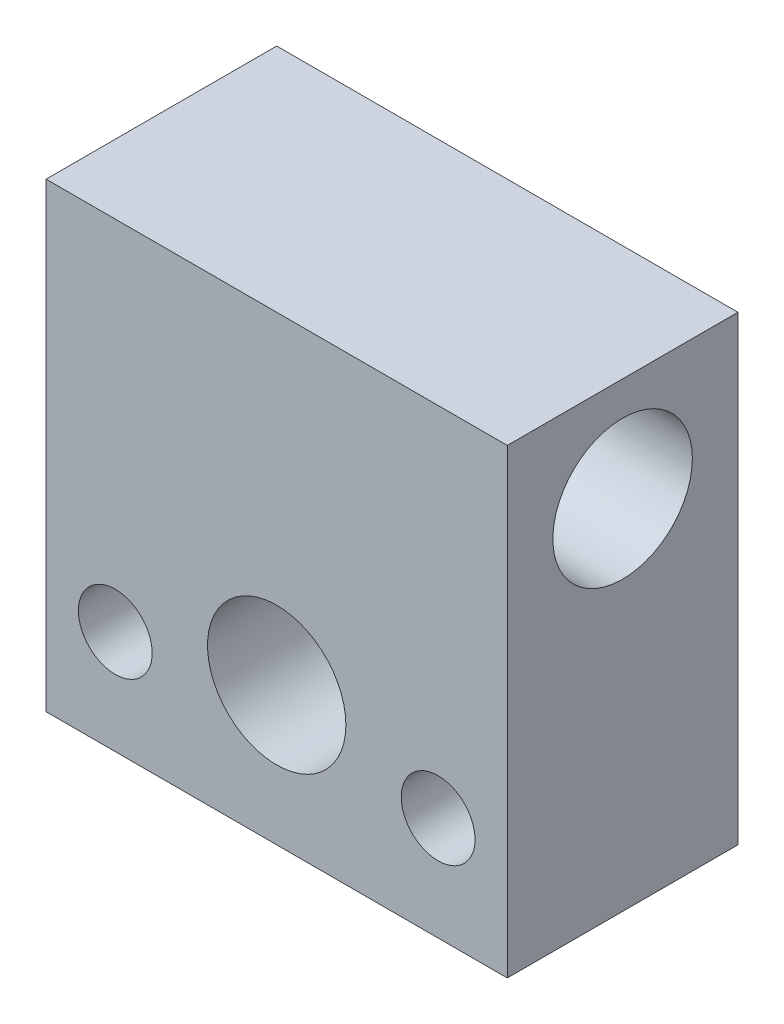
ISO-10303-21;
HEADER;
FILE_DESCRIPTION(('STEP AP214'),'2;1');
FILE_NAME('part.step','',(''),(''),'','','');
FILE_SCHEMA(('AUTOMOTIVE_DESIGN { 1 0 10303 214 1 1 1 1 }'));
ENDSEC;
DATA;
#1=APPLICATION_CONTEXT('core data for automotive mechanical design processes');
#2=APPLICATION_PROTOCOL_DEFINITION('international standard','automotive_design',2000,#1);
#3=PRODUCT_CONTEXT('',#1,'mechanical');
#4=PRODUCT('Part','Part','',(#3));
#5=PRODUCT_RELATED_PRODUCT_CATEGORY('part','',(#4));
#6=PRODUCT_DEFINITION_FORMATION('','',#4);
#7=PRODUCT_DEFINITION_CONTEXT('part definition',#1,'design');
#8=PRODUCT_DEFINITION('design','',#6,#7);
#9=PRODUCT_DEFINITION_SHAPE('','',#8);
#10=(LENGTH_UNIT() NAMED_UNIT(*) SI_UNIT(.MILLI.,.METRE.));
#11=(NAMED_UNIT(*) PLANE_ANGLE_UNIT() SI_UNIT($,.RADIAN.));
#12=(NAMED_UNIT(*) SI_UNIT($,.STERADIAN.) SOLID_ANGLE_UNIT());
#13=UNCERTAINTY_MEASURE_WITH_UNIT(LENGTH_MEASURE(1.E-05),#10,'distance_accuracy_value','');
#14=(GEOMETRIC_REPRESENTATION_CONTEXT(3) GLOBAL_UNCERTAINTY_ASSIGNED_CONTEXT((#13)) GLOBAL_UNIT_ASSIGNED_CONTEXT((#10,
#11,#12)) REPRESENTATION_CONTEXT('',''));
#15=CARTESIAN_POINT('',(0.,0.,0.));
#16=DIRECTION('',(0.,0.,1.));
#17=DIRECTION('',(1.,0.,0.));
#18=AXIS2_PLACEMENT_3D('',#15,#16,#17);
#19=CARTESIAN_POINT('',(-5.,0.,10.));
#20=DIRECTION('',(-1.,0.,0.));
#21=DIRECTION('',(0.,0.,1.));
#22=AXIS2_PLACEMENT_3D('',#19,#20,#21);
#23=PLANE('',#22);
#24=CARTESIAN_POINT('',(-5.,-1.5,2.));
#25=DIRECTION('',(-1.,0.,0.));
#26=DIRECTION('',(0.,0.,1.));
#27=AXIS2_PLACEMENT_3D('',#24,#25,#26);
#28=CIRCLE('',#27,1.);
#29=CARTESIAN_POINT('',(-5.,-1.5,3.));
#30=VERTEX_POINT('',#29);
#31=EDGE_CURVE('E18',#30,#30,#28,.T.);
#32=ORIENTED_EDGE('',*,*,#31,.T.);
#33=EDGE_LOOP('',(#32));
#34=FACE_BOUND('',#33,.T.);
#35=ADVANCED_FACE('F15',(#34),#23,.T.);
#36=CARTESIAN_POINT('',(-6.,0.,0.));
#37=DIRECTION('',(-1.,0.,0.));
#38=DIRECTION('',(0.,0.,1.));
#39=AXIS2_PLACEMENT_3D('',#36,#37,#38);
#40=PLANE('',#39);
#41=CARTESIAN_POINT('',(-6.,-1.5,5.5));
#42=DIRECTION('',(-1.,0.,0.));
#43=DIRECTION('',(0.,0.,1.));
#44=AXIS2_PLACEMENT_3D('',#41,#42,#43);
#45=CIRCLE('',#44,1.5);
#46=CARTESIAN_POINT('',(-6.,-1.5,7.));
#47=VERTEX_POINT('',#46);
#48=EDGE_CURVE('E128',#47,#47,#45,.T.);
#49=ORIENTED_EDGE('',*,*,#48,.T.);
#50=EDGE_LOOP('',(#49));
#51=FACE_BOUND('',#50,.T.);
#52=ADVANCED_FACE('F157',(#51),#40,.T.);
#53=CARTESIAN_POINT('',(0.,5.5,0.));
#54=DIRECTION('',(0.,0.,-1.));
#55=DIRECTION('',(-1.,0.,0.));
#56=AXIS2_PLACEMENT_3D('',#53,#54,#55);
#57=CYLINDRICAL_SURFACE('',#56,1.5);
#58=CARTESIAN_POINT('',(1.5,5.5,1.975));
#59=CARTESIAN_POINT('',(1.49999594047018,5.57900144630801,1.97500356043906));
#60=CARTESIAN_POINT('',(1.49372693576098,5.65804837745387,1.97812566666901));
#61=CARTESIAN_POINT('',(1.46893959830404,5.81376412220572,1.99029966306556));
#62=CARTESIAN_POINT('',(1.45040864995801,5.89043040135985,1.99935766023134));
#63=CARTESIAN_POINT('',(1.40199846961452,6.03896385695773,2.02245479182461));
#64=CARTESIAN_POINT('',(1.37215905632387,6.11084684381869,2.03647643725468));
#65=CARTESIAN_POINT('',(1.30219691790721,6.24849863267949,2.06821357281648));
#66=CARTESIAN_POINT('',(1.26207301806937,6.31426673505646,2.08592948487061));
#67=CARTESIAN_POINT('',(1.16995731065494,6.44222108280155,2.12466073278959));
#68=CARTESIAN_POINT('',(1.11739997976672,6.50395906458766,2.14580990556196));
#69=CARTESIAN_POINT('',(1.0031271487249,6.61815419955558,2.18858021506086));
#70=CARTESIAN_POINT('',(0.941405217206993,6.67060477806009,2.21020167405788));
#71=CARTESIAN_POINT('',(0.804926658722086,6.76873167990099,2.25335964948605));
#72=CARTESIAN_POINT('',(0.729536017881986,6.81359067773629,2.27476493273293));
#73=CARTESIAN_POINT('',(0.571103482437755,6.88980291346821,2.31282681627039));
#74=CARTESIAN_POINT('',(0.4880670033303,6.92116562271595,2.32948674394543));
#75=CARTESIAN_POINT('',(0.321740750954993,6.96747419696827,2.35466323851127));
#76=CARTESIAN_POINT('',(0.238759352163179,6.98328499768358,2.36360494965244));
#77=CARTESIAN_POINT('',(0.0708794694097341,7.00069285570871,2.37347037411611));
#78=CARTESIAN_POINT('',(-0.0140171024281057,7.00230351116717,2.3744017581574));
#79=CARTESIAN_POINT('',(-0.172629443740668,6.99190046308059,2.36848430022382));
#80=CARTESIAN_POINT('',(-0.246490058966555,6.98146052673182,2.36253400278224));
#81=CARTESIAN_POINT('',(-0.391230964006536,6.94997459930692,2.34509525123016));
#82=CARTESIAN_POINT('',(-0.46211032721989,6.92892533676304,2.33360508890698));
#83=CARTESIAN_POINT('',(-0.600898386504531,6.87642947527521,2.30612583887848));
#84=CARTESIAN_POINT('',(-0.668699211124015,6.84475178294496,2.29003805345798));
#85=CARTESIAN_POINT('',(-0.798344551502015,6.77207503652154,2.25517346346266));
#86=CARTESIAN_POINT('',(-0.860186510561525,6.73107200644798,2.23639551316821));
#87=CARTESIAN_POINT('',(-0.984256578247225,6.63496133604325,2.19544298686002));
#88=CARTESIAN_POINT('',(-1.04557656112961,6.57873384380673,2.17313639274875));
#89=CARTESIAN_POINT('',(-1.15830345819555,6.45668082223522,2.12953202590372));
#90=CARTESIAN_POINT('',(-1.20970387570264,6.3908490519359,2.10823492116113));
#91=CARTESIAN_POINT('',(-1.30330651599731,6.24768473858028,2.067873118354));
#92=CARTESIAN_POINT('',(-1.34498421172647,6.16996535849951,2.04895396414971));
#93=CARTESIAN_POINT('',(-1.41428907876496,6.00749420403244,2.01673148934985));
#94=CARTESIAN_POINT('',(-1.44194305133928,5.92275620668402,2.00341746491714));
#95=CARTESIAN_POINT('',(-1.47450721867071,5.78107868035783,1.98757839526593));
#96=CARTESIAN_POINT('',(-1.48404343221979,5.7254041139936,1.98288549806455));
#97=CARTESIAN_POINT('',(-1.49679098596232,5.61316075670564,1.97659516756892));
#98=CARTESIAN_POINT('',(-1.50000290801143,5.55659204852868,1.97499744950821));
#99=CARTESIAN_POINT('',(-1.49999594047018,5.42099855369198,1.97500356043906));
#100=CARTESIAN_POINT('',(-1.49372693576097,5.34195162254613,1.97812566666901));
#101=CARTESIAN_POINT('',(-1.46893959830404,5.18623587779428,1.99029966306556));
#102=CARTESIAN_POINT('',(-1.45040864995801,5.10956959864015,1.99935766023134));
#103=CARTESIAN_POINT('',(-1.40199846961452,4.96103614304227,2.02245479182461));
#104=CARTESIAN_POINT('',(-1.37215905632387,4.88915315618131,2.03647643725468));
#105=CARTESIAN_POINT('',(-1.30219691790721,4.75150136732051,2.06821357281648));
#106=CARTESIAN_POINT('',(-1.26207301806937,4.68573326494354,2.08592948487061));
#107=CARTESIAN_POINT('',(-1.16995731065493,4.55777891719845,2.12466073278959));
#108=CARTESIAN_POINT('',(-1.11739997976672,4.49604093541234,2.14580990556196));
#109=CARTESIAN_POINT('',(-1.0031271487249,4.38184580044442,2.18858021506086));
#110=CARTESIAN_POINT('',(-0.941405217206992,4.32939522193991,2.21020167405788));
#111=CARTESIAN_POINT('',(-0.804926658722085,4.23126832009901,2.25335964948605));
#112=CARTESIAN_POINT('',(-0.729536017881984,4.18640932226371,2.27476493273293));
#113=CARTESIAN_POINT('',(-0.571103482437753,4.11019708653179,2.31282681627039));
#114=CARTESIAN_POINT('',(-0.488067003330298,4.07883437728405,2.32948674394543));
#115=CARTESIAN_POINT('',(-0.321740750954991,4.03252580303173,2.35466323851127));
#116=CARTESIAN_POINT('',(-0.238759352163177,4.01671500231642,2.36360494965244));
#117=CARTESIAN_POINT('',(-0.070879469409732,3.99930714429129,2.37347037411611));
#118=CARTESIAN_POINT('',(0.0140171024281078,3.99769648883283,2.3744017581574));
#119=CARTESIAN_POINT('',(0.17262944374067,4.00809953691941,2.36848430022382));
#120=CARTESIAN_POINT('',(0.246490058966557,4.01853947326818,2.36253400278224));
#121=CARTESIAN_POINT('',(0.391230964006538,4.05002540069308,2.34509525123016));
#122=CARTESIAN_POINT('',(0.462110327219892,4.07107466323696,2.33360508890698));
#123=CARTESIAN_POINT('',(0.600898386504532,4.12357052472479,2.30612583887848));
#124=CARTESIAN_POINT('',(0.668699211124016,4.15524821705504,2.29003805345798));
#125=CARTESIAN_POINT('',(0.798344551502016,4.22792496347846,2.25517346346266));
#126=CARTESIAN_POINT('',(0.860186510561526,4.26892799355202,2.23639551316821));
#127=CARTESIAN_POINT('',(0.984256578247227,4.36503866395675,2.19544298686002));
#128=CARTESIAN_POINT('',(1.04557656112961,4.42126615619327,2.17313639274875));
#129=CARTESIAN_POINT('',(1.15830345819555,4.54331917776478,2.12953202590372));
#130=CARTESIAN_POINT('',(1.20970387570264,4.6091509480641,2.10823492116113));
#131=CARTESIAN_POINT('',(1.30330651599732,4.75231526141973,2.067873118354));
#132=CARTESIAN_POINT('',(1.34498421172647,4.83003464150049,2.04895396414971));
#133=CARTESIAN_POINT('',(1.41428907876496,4.99250579596756,2.01673148934985));
#134=CARTESIAN_POINT('',(1.44194305133928,5.07724379331598,2.00341746491714));
#135=CARTESIAN_POINT('',(1.47450721867071,5.21892131964217,1.98757839526593));
#136=CARTESIAN_POINT('',(1.48404343221979,5.2745958860064,1.98288549806455));
#137=CARTESIAN_POINT('',(1.49679098596232,5.38683924329436,1.97659516756892));
#138=CARTESIAN_POINT('',(1.50000290801143,5.44340795147132,1.97499744950821));
#139=CARTESIAN_POINT('',(1.5,5.5,1.975));
#140=B_SPLINE_CURVE_WITH_KNOTS('',3,(#58,#59,#60,#61,#62,#63,#64,#65,#66,#67,#68,#69,#70,#71,
#72,#73,#74,#75,#76,#77,#78,#79,#80,#81,#82,#83,#84,#85,#86,#87,#88,#89,#90,#91,#92,#93,#94,#95,
#96,#97,#98,#99,#100,#101,#102,#103,#104,#105,#106,#107,#108,#109,#110,#111,#112,#113,#114,#115,
#116,#117,#118,#119,#120,#121,#122,#123,#124,#125,#126,#127,#128,#129,#130,#131,#132,#133,#134,
#135,#136,#137,#138,#139),.UNSPECIFIED.,.T.,.F.,(4,2,2,2,2,2,2,2,2,2,2,2,2,2,2,2,2,2,2,2,2,2,2,
2,2,2,2,2,2,2,2,2,2,2,2,2,2,2,2,2,4),(0.,0.236782321681719,0.473808634445435,0.710007983763761,
0.946234324211956,1.1965638581735,1.44706990138711,1.71660637764891,1.98595339038829,
2.23929197683291,2.49238793826836,2.71583794222608,2.93935689091262,3.16809007155546,
3.39692095903474,3.65420522783989,3.91165743363485,4.18081624560758,4.44945870091991,
4.61909141374399,4.78870851907015,5.02549084075187,5.26251715351558,5.49871650283391,
5.7349428432821,5.98527237724365,6.23577842045725,6.50531489671906,6.77466190945843,
7.02800049590306,7.28109645733851,7.50454646129622,7.72806540998277,7.9567985906256,
8.18562947810489,8.44291374691004,8.700365952705,8.96952476467773,9.23816721999005,
9.40779993281413,9.57741703814029),.UNSPECIFIED.);
#141=CARTESIAN_POINT('',(1.5,5.5,1.975));
#142=VERTEX_POINT('',#141);
#143=EDGE_CURVE('E122',#142,#142,#140,.T.);
#144=ORIENTED_EDGE('',*,*,#143,.T.);
#145=EDGE_LOOP('',(#144));
#146=FACE_BOUND('',#145,.T.);
#147=CARTESIAN_POINT('',(0.,5.5,0.));
#148=DIRECTION('',(0.,0.,-1.));
#149=DIRECTION('',(-1.,0.,0.));
#150=AXIS2_PLACEMENT_3D('',#147,#148,#149);
#151=CIRCLE('',#150,1.5);
#152=CARTESIAN_POINT('',(-1.5,5.5,0.));
#153=VERTEX_POINT('',#152);
#154=EDGE_CURVE('E119',#153,#153,#151,.T.);
#155=ORIENTED_EDGE('',*,*,#154,.T.);
#156=EDGE_LOOP('',(#155));
#157=FACE_BOUND('',#156,.T.);
#158=ADVANCED_FACE('F129',(#146,#157),#57,.F.);
#159=CARTESIAN_POINT('',(-7.,-5.5,5.6843418860808E-11));
#160=DIRECTION('',(0.,0.,-1.));
#161=DIRECTION('',(-1.,0.,0.));
#162=AXIS2_PLACEMENT_3D('',#159,#160,#161);
#163=CONICAL_SURFACE('',#162,2.80000000009795,0.785398163397448);
#164=CARTESIAN_POINT('',(-7.,-5.5,1.2));
#165=DIRECTION('',(0.,0.,1.));
#166=DIRECTION('',(1.,0.,0.));
#167=AXIS2_PLACEMENT_3D('',#164,#165,#166);
#168=CIRCLE('',#167,1.6);
#169=CARTESIAN_POINT('',(-5.4,-5.5,1.2));
#170=VERTEX_POINT('',#169);
#171=EDGE_CURVE('E91',#170,#170,#168,.T.);
#172=ORIENTED_EDGE('',*,*,#171,.T.);
#173=EDGE_LOOP('',(#172));
#174=FACE_BOUND('',#173,.T.);
#175=CARTESIAN_POINT('',(-7.,-5.5,5.6843418860808E-11));
#176=DIRECTION('',(0.,0.,-1.));
#177=DIRECTION('',(-1.,0.,0.));
#178=AXIS2_PLACEMENT_3D('',#175,#176,#177);
#179=CIRCLE('',#178,2.80000000009795);
#180=CARTESIAN_POINT('',(-9.80000000009795,-5.5,5.6843418860808E-11));
#181=VERTEX_POINT('',#180);
#182=EDGE_CURVE('E94',#181,#181,#179,.T.);
#183=ORIENTED_EDGE('',*,*,#182,.T.);
#184=EDGE_LOOP('',(#183));
#185=FACE_BOUND('',#184,.T.);
#186=ADVANCED_FACE('F149',(#174,#185),#163,.F.);
#187=CARTESIAN_POINT('',(7.,-5.5,5.6843418860808E-11));
#188=DIRECTION('',(0.,0.,-1.));
#189=DIRECTION('',(-1.,0.,0.));
#190=AXIS2_PLACEMENT_3D('',#187,#188,#189);
#191=CONICAL_SURFACE('',#190,2.80000000008795,0.785398163397448);
#192=CARTESIAN_POINT('',(7.,-5.5,1.2));
#193=DIRECTION('',(0.,0.,1.));
#194=DIRECTION('',(1.,0.,0.));
#195=AXIS2_PLACEMENT_3D('',#192,#193,#194);
#196=CIRCLE('',#195,1.6);
#197=CARTESIAN_POINT('',(8.6,-5.5,1.2));
#198=VERTEX_POINT('',#197);
#199=EDGE_CURVE('E88',#198,#198,#196,.T.);
#200=ORIENTED_EDGE('',*,*,#199,.T.);
#201=EDGE_LOOP('',(#200));
#202=FACE_BOUND('',#201,.T.);
#203=CARTESIAN_POINT('',(7.,-5.5,5.6843418860808E-11));
#204=DIRECTION('',(0.,0.,-1.));
#205=DIRECTION('',(-1.,0.,0.));
#206=AXIS2_PLACEMENT_3D('',#203,#204,#205);
#207=CIRCLE('',#206,2.80000000008795);
#208=CARTESIAN_POINT('',(4.19999999991205,-5.5,5.6843418860808E-11));
#209=VERTEX_POINT('',#208);
#210=EDGE_CURVE('E116',#209,#209,#207,.T.);
#211=ORIENTED_EDGE('',*,*,#210,.T.);
#212=EDGE_LOOP('',(#211));
#213=FACE_BOUND('',#212,.T.);
#214=ADVANCED_FACE('F146',(#202,#213),#191,.F.);
#215=CARTESIAN_POINT('',(-10.,-1.5,2.));
#216=DIRECTION('',(-1.,0.,0.));
#217=DIRECTION('',(0.,0.,1.));
#218=AXIS2_PLACEMENT_3D('',#215,#216,#217);
#219=CYLINDRICAL_SURFACE('',#218,1.);
#220=ORIENTED_EDGE('',*,*,#31,.F.);
#221=EDGE_LOOP('',(#220));
#222=FACE_BOUND('',#221,.T.);
#223=CARTESIAN_POINT('',(-10.,-1.5,2.));
#224=DIRECTION('',(-1.,0.,0.));
#225=DIRECTION('',(0.,0.,1.));
#226=AXIS2_PLACEMENT_3D('',#223,#224,#225);
#227=CIRCLE('',#226,1.);
#228=CARTESIAN_POINT('',(-10.,-1.5,3.));
#229=VERTEX_POINT('',#228);
#230=EDGE_CURVE('E67',#229,#229,#227,.F.);
#231=ORIENTED_EDGE('',*,*,#230,.F.);
#232=EDGE_LOOP('',(#231));
#233=FACE_BOUND('',#232,.T.);
#234=ADVANCED_FACE('F142',(#222,#233),#219,.F.);
#235=CARTESIAN_POINT('',(-10.,-1.5,5.5));
#236=DIRECTION('',(-1.,0.,0.));
#237=DIRECTION('',(0.,0.,1.));
#238=AXIS2_PLACEMENT_3D('',#235,#236,#237);
#239=CYLINDRICAL_SURFACE('',#238,1.5);
#240=ORIENTED_EDGE('',*,*,#48,.F.);
#241=EDGE_LOOP('',(#240));
#242=FACE_BOUND('',#241,.T.);
#243=CARTESIAN_POINT('',(-10.,-1.5,5.5));
#244=DIRECTION('',(-1.,0.,0.));
#245=DIRECTION('',(0.,0.,1.));
#246=AXIS2_PLACEMENT_3D('',#243,#244,#245);
#247=CIRCLE('',#246,1.5);
#248=CARTESIAN_POINT('',(-10.,-1.5,7.));
#249=VERTEX_POINT('',#248);
#250=EDGE_CURVE('E84',#249,#249,#247,.F.);
#251=ORIENTED_EDGE('',*,*,#250,.F.);
#252=EDGE_LOOP('',(#251));
#253=FACE_BOUND('',#252,.T.);
#254=ADVANCED_FACE('F137',(#242,#253),#239,.F.);
#255=CARTESIAN_POINT('',(10.,5.5,5.));
#256=DIRECTION('',(1.,0.,0.));
#257=DIRECTION('',(0.,0.,-1.));
#258=AXIS2_PLACEMENT_3D('',#255,#256,#257);
#259=CYLINDRICAL_SURFACE('',#258,3.025);
#260=ORIENTED_EDGE('',*,*,#143,.F.);
#261=EDGE_LOOP('',(#260));
#262=FACE_BOUND('',#261,.T.);
#263=CARTESIAN_POINT('',(-10.,5.5,5.));
#264=DIRECTION('',(1.,0.,0.));
#265=DIRECTION('',(0.,0.,-1.));
#266=AXIS2_PLACEMENT_3D('',#263,#264,#265);
#267=CIRCLE('',#266,3.025);
#268=CARTESIAN_POINT('',(-10.,5.5,1.975));
#269=VERTEX_POINT('',#268);
#270=EDGE_CURVE('E81',#269,#269,#267,.T.);
#271=ORIENTED_EDGE('',*,*,#270,.F.);
#272=EDGE_LOOP('',(#271));
#273=FACE_BOUND('',#272,.T.);
#274=CARTESIAN_POINT('',(10.,5.5,5.));
#275=DIRECTION('',(1.,0.,0.));
#276=DIRECTION('',(0.,0.,-1.));
#277=AXIS2_PLACEMENT_3D('',#274,#275,#276);
#278=CIRCLE('',#277,3.025);
#279=CARTESIAN_POINT('',(10.,5.5,1.975));
#280=VERTEX_POINT('',#279);
#281=EDGE_CURVE('E105',#280,#280,#278,.F.);
#282=ORIENTED_EDGE('',*,*,#281,.F.);
#283=EDGE_LOOP('',(#282));
#284=FACE_BOUND('',#283,.T.);
#285=ADVANCED_FACE('F132',(#262,#273,#284),#259,.F.);
#286=CARTESIAN_POINT('',(0.,0.,0.));
#287=DIRECTION('',(0.,0.,1.));
#288=DIRECTION('',(1.,0.,0.));
#289=AXIS2_PLACEMENT_3D('',#286,#287,#288);
#290=PLANE('',#289);
#291=DIRECTION('',(1.,0.,0.));
#292=VECTOR('',#291,1.);
#293=CARTESIAN_POINT('',(-10.,-10.,0.));
#294=LINE('',#293,#292);
#295=CARTESIAN_POINT('',(-10.,-10.,0.));
#296=VERTEX_POINT('',#295);
#297=CARTESIAN_POINT('',(10.,-10.,0.));
#298=VERTEX_POINT('',#297);
#299=EDGE_CURVE('E72',#296,#298,#294,.T.);
#300=ORIENTED_EDGE('',*,*,#299,.F.);
#301=DIRECTION('',(0.,1.,0.));
#302=VECTOR('',#301,1.);
#303=CARTESIAN_POINT('',(-10.,10.,0.));
#304=LINE('',#303,#302);
#305=CARTESIAN_POINT('',(-10.,10.,0.));
#306=VERTEX_POINT('',#305);
#307=EDGE_CURVE('E53',#306,#296,#304,.F.);
#308=ORIENTED_EDGE('',*,*,#307,.F.);
#309=DIRECTION('',(1.,0.,0.));
#310=VECTOR('',#309,1.);
#311=CARTESIAN_POINT('',(10.,10.,0.));
#312=LINE('',#311,#310);
#313=CARTESIAN_POINT('',(10.,10.,0.));
#314=VERTEX_POINT('',#313);
#315=EDGE_CURVE('E58',#314,#306,#312,.F.);
#316=ORIENTED_EDGE('',*,*,#315,.F.);
#317=DIRECTION('',(0.,1.,0.));
#318=VECTOR('',#317,1.);
#319=CARTESIAN_POINT('',(10.,-10.,0.));
#320=LINE('',#319,#318);
#321=EDGE_CURVE('E369',#298,#314,#320,.T.);
#322=ORIENTED_EDGE('',*,*,#321,.F.);
#323=EDGE_LOOP('',(#300,#308,#316,#322));
#324=FACE_BOUND('',#323,.T.);
#325=CARTESIAN_POINT('',(0.,-4.,0.));
#326=DIRECTION('',(0.,0.,1.));
#327=DIRECTION('',(1.,0.,0.));
#328=AXIS2_PLACEMENT_3D('',#325,#326,#327);
#329=CIRCLE('',#328,3.);
#330=CARTESIAN_POINT('',(3.,-4.,0.));
#331=VERTEX_POINT('',#330);
#332=EDGE_CURVE('E68',#331,#331,#329,.T.);
#333=ORIENTED_EDGE('',*,*,#332,.T.);
#334=EDGE_LOOP('',(#333));
#335=FACE_BOUND('',#334,.T.);
#336=ORIENTED_EDGE('',*,*,#182,.F.);
#337=EDGE_LOOP('',(#336));
#338=FACE_BOUND('',#337,.T.);
#339=ORIENTED_EDGE('',*,*,#210,.F.);
#340=EDGE_LOOP('',(#339));
#341=FACE_BOUND('',#340,.T.);
#342=ORIENTED_EDGE('',*,*,#154,.F.);
#343=EDGE_LOOP('',(#342));
#344=FACE_BOUND('',#343,.T.);
#345=ADVANCED_FACE('F70',(#324,#335,#338,#341,#344),#290,.F.);
#346=CARTESIAN_POINT('',(-7.,-5.5,10.));
#347=DIRECTION('',(0.,0.,1.));
#348=DIRECTION('',(1.,0.,0.));
#349=AXIS2_PLACEMENT_3D('',#346,#347,#348);
#350=CYLINDRICAL_SURFACE('',#349,1.6);
#351=ORIENTED_EDGE('',*,*,#171,.F.);
#352=EDGE_LOOP('',(#351));
#353=FACE_BOUND('',#352,.T.);
#354=CARTESIAN_POINT('',(-7.,-5.5,10.));
#355=DIRECTION('',(0.,0.,1.));
#356=DIRECTION('',(1.,0.,0.));
#357=AXIS2_PLACEMENT_3D('',#354,#355,#356);
#358=CIRCLE('',#357,1.6);
#359=CARTESIAN_POINT('',(-5.4,-5.5,10.));
#360=VERTEX_POINT('',#359);
#361=EDGE_CURVE('E102',#360,#360,#358,.F.);
#362=ORIENTED_EDGE('',*,*,#361,.F.);
#363=EDGE_LOOP('',(#362));
#364=FACE_BOUND('',#363,.T.);
#365=ADVANCED_FACE('F186',(#353,#364),#350,.F.);
#366=CARTESIAN_POINT('',(7.,-5.5,10.));
#367=DIRECTION('',(0.,0.,1.));
#368=DIRECTION('',(1.,0.,0.));
#369=AXIS2_PLACEMENT_3D('',#366,#367,#368);
#370=CYLINDRICAL_SURFACE('',#369,1.6);
#371=ORIENTED_EDGE('',*,*,#199,.F.);
#372=EDGE_LOOP('',(#371));
#373=FACE_BOUND('',#372,.T.);
#374=CARTESIAN_POINT('',(7.,-5.5,10.));
#375=DIRECTION('',(0.,0.,1.));
#376=DIRECTION('',(1.,0.,0.));
#377=AXIS2_PLACEMENT_3D('',#374,#375,#376);
#378=CIRCLE('',#377,1.6);
#379=CARTESIAN_POINT('',(8.6,-5.5,10.));
#380=VERTEX_POINT('',#379);
#381=EDGE_CURVE('E99',#380,#380,#378,.F.);
#382=ORIENTED_EDGE('',*,*,#381,.F.);
#383=EDGE_LOOP('',(#382));
#384=FACE_BOUND('',#383,.T.);
#385=ADVANCED_FACE('F183',(#373,#384),#370,.F.);
#386=CARTESIAN_POINT('',(0.,-4.,10.));
#387=DIRECTION('',(0.,0.,1.));
#388=DIRECTION('',(1.,0.,0.));
#389=AXIS2_PLACEMENT_3D('',#386,#387,#388);
#390=CYLINDRICAL_SURFACE('',#389,3.);
#391=ORIENTED_EDGE('',*,*,#332,.F.);
#392=EDGE_LOOP('',(#391));
#393=FACE_BOUND('',#392,.T.);
#394=CARTESIAN_POINT('',(0.,-4.,10.));
#395=DIRECTION('',(0.,0.,1.));
#396=DIRECTION('',(1.,0.,0.));
#397=AXIS2_PLACEMENT_3D('',#394,#395,#396);
#398=CIRCLE('',#397,3.);
#399=CARTESIAN_POINT('',(3.,-4.,10.));
#400=VERTEX_POINT('',#399);
#401=EDGE_CURVE('E95',#400,#400,#398,.F.);
#402=ORIENTED_EDGE('',*,*,#401,.F.);
#403=EDGE_LOOP('',(#402));
#404=FACE_BOUND('',#403,.T.);
#405=ADVANCED_FACE('F180',(#393,#404),#390,.F.);
#406=CARTESIAN_POINT('',(10.,10.,0.));
#407=DIRECTION('',(0.,1.,0.));
#408=DIRECTION('',(0.,0.,1.));
#409=AXIS2_PLACEMENT_3D('',#406,#407,#408);
#410=PLANE('',#409);
#411=DIRECTION('',(0.,0.,1.));
#412=VECTOR('',#411,1.);
#413=CARTESIAN_POINT('',(-10.,10.,0.));
#414=LINE('',#413,#412);
#415=CARTESIAN_POINT('',(-10.,10.,10.));
#416=VERTEX_POINT('',#415);
#417=EDGE_CURVE('E60',#416,#306,#414,.F.);
#418=ORIENTED_EDGE('',*,*,#417,.F.);
#419=DIRECTION('',(1.,0.,0.));
#420=VECTOR('',#419,1.);
#421=CARTESIAN_POINT('',(0.,10.,10.));
#422=LINE('',#421,#420);
#423=CARTESIAN_POINT('',(10.,10.,10.));
#424=VERTEX_POINT('',#423);
#425=EDGE_CURVE('E98',#424,#416,#422,.F.);
#426=ORIENTED_EDGE('',*,*,#425,.F.);
#427=DIRECTION('',(0.,0.,-1.));
#428=VECTOR('',#427,1.);
#429=CARTESIAN_POINT('',(10.,10.,0.));
#430=LINE('',#429,#428);
#431=EDGE_CURVE('E63',#314,#424,#430,.F.);
#432=ORIENTED_EDGE('',*,*,#431,.F.);
#433=ORIENTED_EDGE('',*,*,#315,.T.);
#434=EDGE_LOOP('',(#418,#426,#432,#433));
#435=FACE_BOUND('',#434,.T.);
#436=ADVANCED_FACE('F59',(#435),#410,.T.);
#437=CARTESIAN_POINT('',(-10.,10.,0.));
#438=DIRECTION('',(-1.,0.,0.));
#439=DIRECTION('',(0.,0.,1.));
#440=AXIS2_PLACEMENT_3D('',#437,#438,#439);
#441=PLANE('',#440);
#442=DIRECTION('',(0.,0.,-1.));
#443=VECTOR('',#442,1.);
#444=CARTESIAN_POINT('',(-10.,-10.,0.));
#445=LINE('',#444,#443);
#446=CARTESIAN_POINT('',(-10.,-10.,10.));
#447=VERTEX_POINT('',#446);
#448=EDGE_CURVE('E74',#447,#296,#445,.T.);
#449=ORIENTED_EDGE('',*,*,#448,.F.);
#450=DIRECTION('',(0.,1.,0.));
#451=VECTOR('',#450,1.);
#452=CARTESIAN_POINT('',(-10.,0.,10.));
#453=LINE('',#452,#451);
#454=EDGE_CURVE('E79',#416,#447,#453,.F.);
#455=ORIENTED_EDGE('',*,*,#454,.F.);
#456=ORIENTED_EDGE('',*,*,#417,.T.);
#457=ORIENTED_EDGE('',*,*,#307,.T.);
#458=EDGE_LOOP('',(#449,#455,#456,#457));
#459=FACE_BOUND('',#458,.T.);
#460=ORIENTED_EDGE('',*,*,#270,.T.);
#461=EDGE_LOOP('',(#460));
#462=FACE_BOUND('',#461,.T.);
#463=ORIENTED_EDGE('',*,*,#250,.T.);
#464=EDGE_LOOP('',(#463));
#465=FACE_BOUND('',#464,.T.);
#466=ORIENTED_EDGE('',*,*,#230,.T.);
#467=EDGE_LOOP('',(#466));
#468=FACE_BOUND('',#467,.T.);
#469=ADVANCED_FACE('F76',(#459,#462,#465,#468),#441,.T.);
#470=CARTESIAN_POINT('',(-10.,-10.,0.));
#471=DIRECTION('',(0.,-1.,0.));
#472=DIRECTION('',(0.,0.,-1.));
#473=AXIS2_PLACEMENT_3D('',#470,#471,#472);
#474=PLANE('',#473);
#475=DIRECTION('',(0.,0.,-1.));
#476=VECTOR('',#475,1.);
#477=CARTESIAN_POINT('',(10.,-10.,0.));
#478=LINE('',#477,#476);
#479=CARTESIAN_POINT('',(10.,-10.,10.));
#480=VERTEX_POINT('',#479);
#481=EDGE_CURVE('E33',#480,#298,#478,.T.);
#482=ORIENTED_EDGE('',*,*,#481,.F.);
#483=DIRECTION('',(1.,0.,0.));
#484=VECTOR('',#483,1.);
#485=CARTESIAN_POINT('',(0.,-10.,10.));
#486=LINE('',#485,#484);
#487=EDGE_CURVE('E24',#447,#480,#486,.T.);
#488=ORIENTED_EDGE('',*,*,#487,.F.);
#489=ORIENTED_EDGE('',*,*,#448,.T.);
#490=ORIENTED_EDGE('',*,*,#299,.T.);
#491=EDGE_LOOP('',(#482,#488,#489,#490));
#492=FACE_BOUND('',#491,.T.);
#493=ADVANCED_FACE('F168',(#492),#474,.T.);
#494=CARTESIAN_POINT('',(10.,-10.,0.));
#495=DIRECTION('',(1.,0.,0.));
#496=DIRECTION('',(0.,0.,-1.));
#497=AXIS2_PLACEMENT_3D('',#494,#495,#496);
#498=PLANE('',#497);
#499=ORIENTED_EDGE('',*,*,#431,.T.);
#500=DIRECTION('',(0.,1.,0.));
#501=VECTOR('',#500,1.);
#502=CARTESIAN_POINT('',(10.,0.,10.));
#503=LINE('',#502,#501);
#504=EDGE_CURVE('E10',#480,#424,#503,.T.);
#505=ORIENTED_EDGE('',*,*,#504,.F.);
#506=ORIENTED_EDGE('',*,*,#481,.T.);
#507=ORIENTED_EDGE('',*,*,#321,.T.);
#508=EDGE_LOOP('',(#499,#505,#506,#507));
#509=FACE_BOUND('',#508,.T.);
#510=ORIENTED_EDGE('',*,*,#281,.T.);
#511=EDGE_LOOP('',(#510));
#512=FACE_BOUND('',#511,.T.);
#513=ADVANCED_FACE('F162',(#509,#512),#498,.T.);
#514=CARTESIAN_POINT('',(0.,0.,10.));
#515=DIRECTION('',(0.,0.,1.));
#516=DIRECTION('',(1.,0.,0.));
#517=AXIS2_PLACEMENT_3D('',#514,#515,#516);
#518=PLANE('',#517);
#519=ORIENTED_EDGE('',*,*,#487,.T.);
#520=ORIENTED_EDGE('',*,*,#504,.T.);
#521=ORIENTED_EDGE('',*,*,#425,.T.);
#522=ORIENTED_EDGE('',*,*,#454,.T.);
#523=EDGE_LOOP('',(#519,#520,#521,#522));
#524=FACE_BOUND('',#523,.T.);
#525=ORIENTED_EDGE('',*,*,#401,.T.);
#526=EDGE_LOOP('',(#525));
#527=FACE_BOUND('',#526,.T.);
#528=ORIENTED_EDGE('',*,*,#381,.T.);
#529=EDGE_LOOP('',(#528));
#530=FACE_BOUND('',#529,.T.);
#531=ORIENTED_EDGE('',*,*,#361,.T.);
#532=EDGE_LOOP('',(#531));
#533=FACE_BOUND('',#532,.T.);
#534=ADVANCED_FACE('F160',(#524,#527,#530,#533),#518,.T.);
#535=CLOSED_SHELL('',(#35,#52,#158,#186,#214,#234,#254,#285,#345,#365,#385,#405,#436,#469,#493,
#513,#534));
#536=MANIFOLD_SOLID_BREP('B1',#535);
#537=ADVANCED_BREP_SHAPE_REPRESENTATION('',(#18,#536),#14);
#538=SHAPE_DEFINITION_REPRESENTATION(#9,#537);
ENDSEC;
END-ISO-10303-21;
